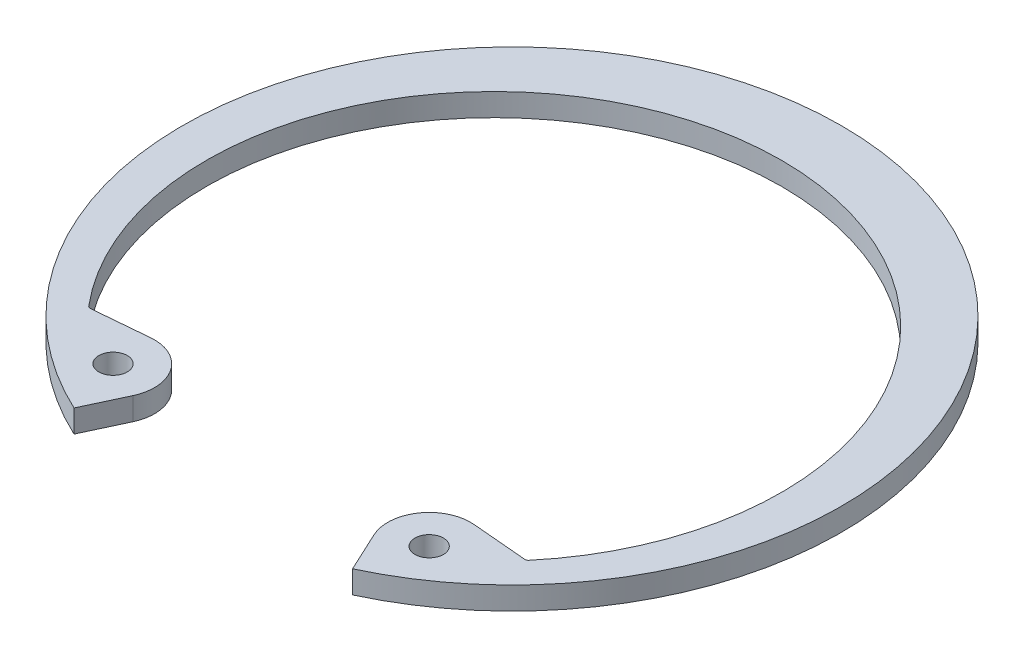
ISO-10303-21;
HEADER;
FILE_DESCRIPTION(('STEP AP214'),'2;1');
FILE_NAME('part.step','',(''),(''),'','','');
FILE_SCHEMA(('AUTOMOTIVE_DESIGN { 1 0 10303 214 1 1 1 1 }'));
ENDSEC;
DATA;
#1=APPLICATION_CONTEXT('core data for automotive mechanical design processes');
#2=APPLICATION_PROTOCOL_DEFINITION('international standard','automotive_design',2000,#1);
#3=PRODUCT_CONTEXT('',#1,'mechanical');
#4=PRODUCT('Part','Part','',(#3));
#5=PRODUCT_RELATED_PRODUCT_CATEGORY('part','',(#4));
#6=PRODUCT_DEFINITION_FORMATION('','',#4);
#7=PRODUCT_DEFINITION_CONTEXT('part definition',#1,'design');
#8=PRODUCT_DEFINITION('design','',#6,#7);
#9=PRODUCT_DEFINITION_SHAPE('','',#8);
#10=(LENGTH_UNIT() NAMED_UNIT(*) SI_UNIT(.MILLI.,.METRE.));
#11=(NAMED_UNIT(*) PLANE_ANGLE_UNIT() SI_UNIT($,.RADIAN.));
#12=(NAMED_UNIT(*) SI_UNIT($,.STERADIAN.) SOLID_ANGLE_UNIT());
#13=UNCERTAINTY_MEASURE_WITH_UNIT(LENGTH_MEASURE(1.E-05),#10,'distance_accuracy_value','');
#14=(GEOMETRIC_REPRESENTATION_CONTEXT(3) GLOBAL_UNCERTAINTY_ASSIGNED_CONTEXT((#13)) GLOBAL_UNIT_ASSIGNED_CONTEXT((#10,
#11,#12)) REPRESENTATION_CONTEXT('',''));
#15=CARTESIAN_POINT('',(0.,0.,0.));
#16=DIRECTION('',(0.,0.,1.));
#17=DIRECTION('',(1.,0.,0.));
#18=AXIS2_PLACEMENT_3D('',#15,#16,#17);
#19=CARTESIAN_POINT('',(10.9888036399848,-1.5748,16.744042909998));
#20=DIRECTION('',(0.,1.,0.));
#21=DIRECTION('',(0.,0.,1.));
#22=AXIS2_PLACEMENT_3D('',#19,#20,#21);
#23=CYLINDRICAL_SURFACE('',#22,2.8829);
#24=CARTESIAN_POINT('',(10.9888036399848,0.,16.744042909998));
#25=DIRECTION('',(0.,1.,0.));
#26=DIRECTION('',(0.,0.,-1.));
#27=AXIS2_PLACEMENT_3D('',#24,#25,#26);
#28=CIRCLE('',#27,2.8829);
#29=CARTESIAN_POINT('',(11.240064930752,0.,13.8721132148693));
#30=VERTEX_POINT('',#29);
#31=CARTESIAN_POINT('',(8.37600892073683,0.,17.9624090967702));
#32=VERTEX_POINT('',#31);
#33=EDGE_CURVE('E114',#30,#32,#28,.T.);
#34=ORIENTED_EDGE('',*,*,#33,.F.);
#35=DIRECTION('',(0.,1.,0.));
#36=VECTOR('',#35,1.);
#37=CARTESIAN_POINT('',(11.240064930752,-1.5748,13.8721132148693));
#38=LINE('',#37,#36);
#39=CARTESIAN_POINT('',(11.240064930752,-1.5748,13.8721132148693));
#40=VERTEX_POINT('',#39);
#41=EDGE_CURVE('E172',#40,#30,#38,.T.);
#42=ORIENTED_EDGE('',*,*,#41,.F.);
#43=CARTESIAN_POINT('',(10.9888036399848,-1.5748,16.744042909998));
#44=DIRECTION('',(0.,1.,0.));
#45=DIRECTION('',(0.,0.,-1.));
#46=AXIS2_PLACEMENT_3D('',#43,#44,#45);
#47=CIRCLE('',#46,2.8829);
#48=CARTESIAN_POINT('',(8.37600892073683,-1.5748,17.9624090967702));
#49=VERTEX_POINT('',#48);
#50=EDGE_CURVE('E116',#40,#49,#47,.T.);
#51=ORIENTED_EDGE('',*,*,#50,.T.);
#52=DIRECTION('',(0.,1.,0.));
#53=VECTOR('',#52,1.);
#54=CARTESIAN_POINT('',(8.37600892073683,-1.5748,17.9624090967702));
#55=LINE('',#54,#53);
#56=EDGE_CURVE('E110',#49,#32,#55,.T.);
#57=ORIENTED_EDGE('',*,*,#56,.T.);
#58=EDGE_LOOP('',(#34,#42,#51,#57));
#59=FACE_BOUND('',#58,.T.);
#60=ADVANCED_FACE('F36',(#59),#23,.T.);
#61=CARTESIAN_POINT('',(15.2181746807128,-1.5748,14.2201527202528));
#62=DIRECTION('',(0.0871557427476599,0.,-0.996194698091745));
#63=DIRECTION('',(-0.996194698091746,0.,-0.0871557427476599));
#64=AXIS2_PLACEMENT_3D('',#61,#62,#63);
#65=PLANE('',#64);
#66=DIRECTION('',(-0.996194698091745,0.,-0.0871557427476599));
#67=VECTOR('',#66,1.);
#68=CARTESIAN_POINT('',(15.2181746807128,0.,14.2201527202528));
#69=LINE('',#68,#67);
#70=CARTESIAN_POINT('',(15.0871573079693,0.,14.2086901854128));
#71=VERTEX_POINT('',#70);
#72=EDGE_CURVE('E131',#71,#30,#69,.T.);
#73=ORIENTED_EDGE('',*,*,#72,.F.);
#74=DIRECTION('',(0.,-1.,0.));
#75=VECTOR('',#74,1.);
#76=CARTESIAN_POINT('',(15.0871573079693,-1.5748,14.2086901854128));
#77=LINE('',#76,#75);
#78=CARTESIAN_POINT('',(15.0871573079693,-1.5748,14.2086901854128));
#79=VERTEX_POINT('',#78);
#80=EDGE_CURVE('E50',#71,#79,#77,.T.);
#81=ORIENTED_EDGE('',*,*,#80,.T.);
#82=DIRECTION('',(-0.996194698091745,0.,-0.0871557427476599));
#83=VECTOR('',#82,1.);
#84=CARTESIAN_POINT('',(15.2181746807128,-1.5748,14.2201527202528));
#85=LINE('',#84,#83);
#86=EDGE_CURVE('E121',#79,#40,#85,.T.);
#87=ORIENTED_EDGE('',*,*,#86,.T.);
#88=ORIENTED_EDGE('',*,*,#41,.T.);
#89=EDGE_LOOP('',(#73,#81,#87,#88));
#90=FACE_BOUND('',#89,.T.);
#91=ADVANCED_FACE('F213',(#90),#65,.T.);
#92=CARTESIAN_POINT('',(0.,-1.5748,1.25014680806621));
#93=DIRECTION('',(0.,1.,0.));
#94=DIRECTION('',(0.,0.,1.));
#95=AXIS2_PLACEMENT_3D('',#92,#93,#94);
#96=CYLINDRICAL_SURFACE('',#95,19.9953468080662);
#97=CARTESIAN_POINT('',(0.,0.,1.25014680806621));
#98=DIRECTION('',(0.,-1.,0.));
#99=DIRECTION('',(0.,0.,1.));
#100=AXIS2_PLACEMENT_3D('',#97,#98,#99);
#101=CIRCLE('',#100,19.9953468080662);
#102=CARTESIAN_POINT('',(-15.3036970486787,0.,14.119130863426));
#103=VERTEX_POINT('',#102);
#104=CARTESIAN_POINT('',(15.3036970486787,0.,14.119130863426));
#105=VERTEX_POINT('',#104);
#106=EDGE_CURVE('E150',#103,#105,#101,.T.);
#107=ORIENTED_EDGE('',*,*,#106,.F.);
#108=DIRECTION('',(0.,1.,0.));
#109=VECTOR('',#108,1.);
#110=CARTESIAN_POINT('',(-15.3036970486787,-1.5748,14.119130863426));
#111=LINE('',#110,#109);
#112=CARTESIAN_POINT('',(-15.3036970486787,-1.5748,14.119130863426));
#113=VERTEX_POINT('',#112);
#114=EDGE_CURVE('E187',#103,#113,#111,.F.);
#115=ORIENTED_EDGE('',*,*,#114,.T.);
#116=CARTESIAN_POINT('',(0.,-1.5748,1.25014680806621));
#117=DIRECTION('',(0.,-1.,0.));
#118=DIRECTION('',(0.,0.,1.));
#119=AXIS2_PLACEMENT_3D('',#116,#117,#118);
#120=CIRCLE('',#119,19.9953468080662);
#121=CARTESIAN_POINT('',(15.3036970486787,-1.5748,14.119130863426));
#122=VERTEX_POINT('',#121);
#123=EDGE_CURVE('E168',#113,#122,#120,.T.);
#124=ORIENTED_EDGE('',*,*,#123,.T.);
#125=DIRECTION('',(0.,1.,0.));
#126=VECTOR('',#125,1.);
#127=CARTESIAN_POINT('',(15.3036970486787,-1.5748,14.119130863426));
#128=LINE('',#127,#126);
#129=EDGE_CURVE('E184',#122,#105,#128,.T.);
#130=ORIENTED_EDGE('',*,*,#129,.T.);
#131=EDGE_LOOP('',(#107,#115,#124,#130));
#132=FACE_BOUND('',#131,.T.);
#133=ADVANCED_FACE('F208',(#132),#96,.F.);
#134=CARTESIAN_POINT('',(-15.2181746807128,-1.5748,14.2201527202528));
#135=DIRECTION('',(-0.0871557427476563,0.,-0.996194698091746));
#136=DIRECTION('',(-0.996194698091746,0.,0.0871557427476563));
#137=AXIS2_PLACEMENT_3D('',#134,#135,#136);
#138=PLANE('',#137);
#139=DIRECTION('',(-0.996194698091746,0.,0.0871557427476563));
#140=VECTOR('',#139,1.);
#141=CARTESIAN_POINT('',(-15.2181746807128,-1.5748,14.2201527202528));
#142=LINE('',#141,#140);
#143=CARTESIAN_POINT('',(-11.240064930752,-1.5748,13.8721132148693));
#144=VERTEX_POINT('',#143);
#145=CARTESIAN_POINT('',(-15.0871573079693,-1.5748,14.2086901854128));
#146=VERTEX_POINT('',#145);
#147=EDGE_CURVE('E165',#144,#146,#142,.T.);
#148=ORIENTED_EDGE('',*,*,#147,.T.);
#149=DIRECTION('',(0.,-1.,0.));
#150=VECTOR('',#149,1.);
#151=CARTESIAN_POINT('',(-15.0871573079693,0.,14.2086901854128));
#152=LINE('',#151,#150);
#153=CARTESIAN_POINT('',(-15.0871573079693,0.,14.2086901854128));
#154=VERTEX_POINT('',#153);
#155=EDGE_CURVE('E174',#146,#154,#152,.F.);
#156=ORIENTED_EDGE('',*,*,#155,.T.);
#157=DIRECTION('',(-0.996194698091746,0.,0.0871557427476563));
#158=VECTOR('',#157,1.);
#159=CARTESIAN_POINT('',(-15.2181746807128,0.,14.2201527202528));
#160=LINE('',#159,#158);
#161=CARTESIAN_POINT('',(-11.240064930752,0.,13.8721132148693));
#162=VERTEX_POINT('',#161);
#163=EDGE_CURVE('E147',#162,#154,#160,.T.);
#164=ORIENTED_EDGE('',*,*,#163,.F.);
#165=DIRECTION('',(0.,1.,0.));
#166=VECTOR('',#165,1.);
#167=CARTESIAN_POINT('',(-11.240064930752,-1.5748,13.8721132148693));
#168=LINE('',#167,#166);
#169=EDGE_CURVE('E175',#144,#162,#168,.T.);
#170=ORIENTED_EDGE('',*,*,#169,.F.);
#171=EDGE_LOOP('',(#148,#156,#164,#170));
#172=FACE_BOUND('',#171,.T.);
#173=ADVANCED_FACE('F203',(#172),#138,.T.);
#174=CARTESIAN_POINT('',(-10.9888036399848,-1.5748,16.744042909998));
#175=DIRECTION('',(0.,1.,0.));
#176=DIRECTION('',(0.,0.,1.));
#177=AXIS2_PLACEMENT_3D('',#174,#175,#176);
#178=CYLINDRICAL_SURFACE('',#177,2.8829);
#179=CARTESIAN_POINT('',(-10.9888036399848,0.,16.744042909998));
#180=DIRECTION('',(0.,1.,0.));
#181=DIRECTION('',(0.,0.,1.));
#182=AXIS2_PLACEMENT_3D('',#179,#180,#181);
#183=CIRCLE('',#182,2.8829);
#184=CARTESIAN_POINT('',(-8.37600892073683,0.,17.9624090967702));
#185=VERTEX_POINT('',#184);
#186=EDGE_CURVE('E144',#185,#162,#183,.T.);
#187=ORIENTED_EDGE('',*,*,#186,.F.);
#188=DIRECTION('',(0.,1.,0.));
#189=VECTOR('',#188,1.);
#190=CARTESIAN_POINT('',(-8.37600892073683,-1.5748,17.9624090967702));
#191=LINE('',#190,#189);
#192=CARTESIAN_POINT('',(-8.37600892073683,-1.5748,17.9624090967702));
#193=VERTEX_POINT('',#192);
#194=EDGE_CURVE('E177',#193,#185,#191,.T.);
#195=ORIENTED_EDGE('',*,*,#194,.F.);
#196=CARTESIAN_POINT('',(-10.9888036399848,-1.5748,16.744042909998));
#197=DIRECTION('',(0.,1.,0.));
#198=DIRECTION('',(0.,0.,1.));
#199=AXIS2_PLACEMENT_3D('',#196,#197,#198);
#200=CIRCLE('',#199,2.8829);
#201=EDGE_CURVE('E162',#193,#144,#200,.T.);
#202=ORIENTED_EDGE('',*,*,#201,.T.);
#203=ORIENTED_EDGE('',*,*,#169,.T.);
#204=EDGE_LOOP('',(#187,#195,#202,#203));
#205=FACE_BOUND('',#204,.T.);
#206=ADVANCED_FACE('F226',(#205),#178,.T.);
#207=CARTESIAN_POINT('',(-9.68252247108869,-1.5748,20.7642364472393));
#208=DIRECTION('',(0.906307787036652,0.,0.422618261740695));
#209=DIRECTION('',(0.422618261740695,0.,-0.906307787036652));
#210=AXIS2_PLACEMENT_3D('',#207,#208,#209);
#211=PLANE('',#210);
#212=DIRECTION('',(0.422618261740695,0.,-0.906307787036652));
#213=VECTOR('',#212,1.);
#214=CARTESIAN_POINT('',(-9.68252247108869,0.,20.7642364472393));
#215=LINE('',#214,#213);
#216=CARTESIAN_POINT('',(-9.6825224710887,0.,20.7642364472393));
#217=VERTEX_POINT('',#216);
#218=EDGE_CURVE('E141',#217,#185,#215,.T.);
#219=ORIENTED_EDGE('',*,*,#218,.F.);
#220=DIRECTION('',(0.,1.,0.));
#221=VECTOR('',#220,1.);
#222=CARTESIAN_POINT('',(-9.6825224710887,-1.5748,20.7642364472393));
#223=LINE('',#222,#221);
#224=CARTESIAN_POINT('',(-9.6825224710887,-1.5748,20.7642364472393));
#225=VERTEX_POINT('',#224);
#226=EDGE_CURVE('E179',#225,#217,#223,.T.);
#227=ORIENTED_EDGE('',*,*,#226,.F.);
#228=DIRECTION('',(0.422618261740695,0.,-0.906307787036652));
#229=VECTOR('',#228,1.);
#230=CARTESIAN_POINT('',(-9.68252247108869,-1.5748,20.7642364472393));
#231=LINE('',#230,#229);
#232=EDGE_CURVE('E159',#225,#193,#231,.T.);
#233=ORIENTED_EDGE('',*,*,#232,.T.);
#234=ORIENTED_EDGE('',*,*,#194,.T.);
#235=EDGE_LOOP('',(#219,#227,#233,#234));
#236=FACE_BOUND('',#235,.T.);
#237=ADVANCED_FACE('F229',(#236),#211,.T.);
#238=CARTESIAN_POINT('',(0.,-1.5748,0.));
#239=DIRECTION('',(0.,1.,0.));
#240=DIRECTION('',(0.,0.,1.));
#241=AXIS2_PLACEMENT_3D('',#238,#239,#240);
#242=CYLINDRICAL_SURFACE('',#241,22.9108);
#243=CARTESIAN_POINT('',(0.,0.,0.));
#244=DIRECTION('',(0.,1.,0.));
#245=DIRECTION('',(0.,0.,1.));
#246=AXIS2_PLACEMENT_3D('',#243,#244,#245);
#247=CIRCLE('',#246,22.9108);
#248=CARTESIAN_POINT('',(9.68252247108869,0.,20.7642364472393));
#249=VERTEX_POINT('',#248);
#250=EDGE_CURVE('E128',#249,#217,#247,.T.);
#251=ORIENTED_EDGE('',*,*,#250,.F.);
#252=DIRECTION('',(0.,1.,0.));
#253=VECTOR('',#252,1.);
#254=CARTESIAN_POINT('',(9.68252247108869,-1.5748,20.7642364472393));
#255=LINE('',#254,#253);
#256=CARTESIAN_POINT('',(9.68252247108869,-1.5748,20.7642364472393));
#257=VERTEX_POINT('',#256);
#258=EDGE_CURVE('E120',#257,#249,#255,.T.);
#259=ORIENTED_EDGE('',*,*,#258,.F.);
#260=CARTESIAN_POINT('',(0.,-1.5748,0.));
#261=DIRECTION('',(0.,1.,0.));
#262=DIRECTION('',(0.,0.,1.));
#263=AXIS2_PLACEMENT_3D('',#260,#261,#262);
#264=CIRCLE('',#263,22.9108);
#265=EDGE_CURVE('E156',#257,#225,#264,.T.);
#266=ORIENTED_EDGE('',*,*,#265,.T.);
#267=ORIENTED_EDGE('',*,*,#226,.T.);
#268=EDGE_LOOP('',(#251,#259,#266,#267));
#269=FACE_BOUND('',#268,.T.);
#270=ADVANCED_FACE('F233',(#269),#242,.T.);
#271=CARTESIAN_POINT('',(9.68252247108869,-1.5748,20.7642364472393));
#272=DIRECTION('',(-0.906307787036652,0.,0.422618261740695));
#273=DIRECTION('',(0.422618261740695,0.,0.906307787036652));
#274=AXIS2_PLACEMENT_3D('',#271,#272,#273);
#275=PLANE('',#274);
#276=DIRECTION('',(0.422618261740695,0.,0.906307787036652));
#277=VECTOR('',#276,1.);
#278=CARTESIAN_POINT('',(9.68252247108869,0.,20.7642364472393));
#279=LINE('',#278,#277);
#280=EDGE_CURVE('E124',#32,#249,#279,.T.);
#281=ORIENTED_EDGE('',*,*,#280,.F.);
#282=ORIENTED_EDGE('',*,*,#56,.F.);
#283=DIRECTION('',(0.422618261740695,0.,0.906307787036652));
#284=VECTOR('',#283,1.);
#285=CARTESIAN_POINT('',(9.68252247108869,-1.5748,20.7642364472393));
#286=LINE('',#285,#284);
#287=EDGE_CURVE('E154',#49,#257,#286,.T.);
#288=ORIENTED_EDGE('',*,*,#287,.T.);
#289=ORIENTED_EDGE('',*,*,#258,.T.);
#290=EDGE_LOOP('',(#281,#282,#288,#289));
#291=FACE_BOUND('',#290,.T.);
#292=ADVANCED_FACE('F125',(#291),#275,.T.);
#293=CARTESIAN_POINT('',(10.9888036399848,-1.5748,16.744042909998));
#294=DIRECTION('',(0.,-1.,0.));
#295=DIRECTION('',(0.,0.,-1.));
#296=AXIS2_PLACEMENT_3D('',#293,#294,#295);
#297=PLANE('',#296);
#298=CARTESIAN_POINT('',(-10.9888036399848,-1.5748,16.744042909998));
#299=DIRECTION('',(0.,1.,0.));
#300=DIRECTION('',(0.,0.,1.));
#301=AXIS2_PLACEMENT_3D('',#298,#299,#300);
#302=CIRCLE('',#301,0.990599999999999);
#303=CARTESIAN_POINT('',(-10.9888036399848,-1.5748,17.734642909998));
#304=VERTEX_POINT('',#303);
#305=EDGE_CURVE('E250',#304,#304,#302,.T.);
#306=ORIENTED_EDGE('',*,*,#305,.T.);
#307=EDGE_LOOP('',(#306));
#308=FACE_BOUND('',#307,.T.);
#309=CARTESIAN_POINT('',(10.9888036399848,-1.5748,16.744042909998));
#310=DIRECTION('',(0.,1.,0.));
#311=DIRECTION('',(0.,0.,1.));
#312=AXIS2_PLACEMENT_3D('',#309,#310,#311);
#313=CIRCLE('',#312,0.990599999999999);
#314=CARTESIAN_POINT('',(10.9888036399848,-1.5748,17.734642909998));
#315=VERTEX_POINT('',#314);
#316=EDGE_CURVE('E133',#315,#315,#313,.T.);
#317=ORIENTED_EDGE('',*,*,#316,.T.);
#318=EDGE_LOOP('',(#317));
#319=FACE_BOUND('',#318,.T.);
#320=ORIENTED_EDGE('',*,*,#50,.F.);
#321=ORIENTED_EDGE('',*,*,#86,.F.);
#322=CARTESIAN_POINT('',(15.1092948666272,-1.5748,13.9556567320975));
#323=DIRECTION('',(0.,-1.,0.));
#324=DIRECTION('',(0.,0.,-1.));
#325=AXIS2_PLACEMENT_3D('',#322,#323,#324);
#326=CIRCLE('',#325,0.254);
#327=EDGE_CURVE('E11',#79,#122,#326,.F.);
#328=ORIENTED_EDGE('',*,*,#327,.T.);
#329=ORIENTED_EDGE('',*,*,#123,.F.);
#330=CARTESIAN_POINT('',(-15.1092948666272,-1.5748,13.9556567320975));
#331=DIRECTION('',(0.,-1.,0.));
#332=DIRECTION('',(0.,0.,-1.));
#333=AXIS2_PLACEMENT_3D('',#330,#331,#332);
#334=CIRCLE('',#333,0.254);
#335=EDGE_CURVE('E192',#113,#146,#334,.F.);
#336=ORIENTED_EDGE('',*,*,#335,.T.);
#337=ORIENTED_EDGE('',*,*,#147,.F.);
#338=ORIENTED_EDGE('',*,*,#201,.F.);
#339=ORIENTED_EDGE('',*,*,#232,.F.);
#340=ORIENTED_EDGE('',*,*,#265,.F.);
#341=ORIENTED_EDGE('',*,*,#287,.F.);
#342=EDGE_LOOP('',(#320,#321,#328,#329,#336,#337,#338,#339,#340,#341));
#343=FACE_BOUND('',#342,.T.);
#344=ADVANCED_FACE('F197',(#308,#319,#343),#297,.T.);
#345=CARTESIAN_POINT('',(10.9888036399848,0.,16.744042909998));
#346=DIRECTION('',(0.,-1.,0.));
#347=DIRECTION('',(0.,0.,-1.));
#348=AXIS2_PLACEMENT_3D('',#345,#346,#347);
#349=PLANE('',#348);
#350=CARTESIAN_POINT('',(-10.9888036399848,0.,16.744042909998));
#351=DIRECTION('',(0.,1.,0.));
#352=DIRECTION('',(0.,0.,1.));
#353=AXIS2_PLACEMENT_3D('',#350,#351,#352);
#354=CIRCLE('',#353,0.990599999999999);
#355=CARTESIAN_POINT('',(-10.9888036399848,0.,17.734642909998));
#356=VERTEX_POINT('',#355);
#357=EDGE_CURVE('E260',#356,#356,#354,.T.);
#358=ORIENTED_EDGE('',*,*,#357,.F.);
#359=EDGE_LOOP('',(#358));
#360=FACE_BOUND('',#359,.T.);
#361=CARTESIAN_POINT('',(10.9888036399848,0.,16.744042909998));
#362=DIRECTION('',(0.,1.,0.));
#363=DIRECTION('',(0.,0.,1.));
#364=AXIS2_PLACEMENT_3D('',#361,#362,#363);
#365=CIRCLE('',#364,0.990599999999999);
#366=CARTESIAN_POINT('',(10.9888036399848,0.,17.734642909998));
#367=VERTEX_POINT('',#366);
#368=EDGE_CURVE('E136',#367,#367,#365,.T.);
#369=ORIENTED_EDGE('',*,*,#368,.F.);
#370=EDGE_LOOP('',(#369));
#371=FACE_BOUND('',#370,.T.);
#372=ORIENTED_EDGE('',*,*,#33,.T.);
#373=ORIENTED_EDGE('',*,*,#280,.T.);
#374=ORIENTED_EDGE('',*,*,#250,.T.);
#375=ORIENTED_EDGE('',*,*,#218,.T.);
#376=ORIENTED_EDGE('',*,*,#186,.T.);
#377=ORIENTED_EDGE('',*,*,#163,.T.);
#378=CARTESIAN_POINT('',(-15.1092948666272,0.,13.9556567320975));
#379=DIRECTION('',(0.,-1.,0.));
#380=DIRECTION('',(0.,0.,-1.));
#381=AXIS2_PLACEMENT_3D('',#378,#379,#380);
#382=CIRCLE('',#381,0.254);
#383=EDGE_CURVE('E190',#154,#103,#382,.T.);
#384=ORIENTED_EDGE('',*,*,#383,.T.);
#385=ORIENTED_EDGE('',*,*,#106,.T.);
#386=CARTESIAN_POINT('',(15.1092948666272,0.,13.9556567320975));
#387=DIRECTION('',(0.,-1.,0.));
#388=DIRECTION('',(0.,0.,-1.));
#389=AXIS2_PLACEMENT_3D('',#386,#387,#388);
#390=CIRCLE('',#389,0.254);
#391=EDGE_CURVE('E43',#105,#71,#390,.T.);
#392=ORIENTED_EDGE('',*,*,#391,.T.);
#393=ORIENTED_EDGE('',*,*,#72,.T.);
#394=EDGE_LOOP('',(#372,#373,#374,#375,#376,#377,#384,#385,#392,#393));
#395=FACE_BOUND('',#394,.T.);
#396=ADVANCED_FACE('F130',(#360,#371,#395),#349,.F.);
#397=CARTESIAN_POINT('',(10.9888036399848,-1.5748,16.744042909998));
#398=DIRECTION('',(0.,1.,0.));
#399=DIRECTION('',(0.,0.,1.));
#400=AXIS2_PLACEMENT_3D('',#397,#398,#399);
#401=CYLINDRICAL_SURFACE('',#400,0.990599999999999);
#402=ORIENTED_EDGE('',*,*,#316,.F.);
#403=EDGE_LOOP('',(#402));
#404=FACE_BOUND('',#403,.T.);
#405=ORIENTED_EDGE('',*,*,#368,.T.);
#406=EDGE_LOOP('',(#405));
#407=FACE_BOUND('',#406,.T.);
#408=ADVANCED_FACE('F245',(#404,#407),#401,.F.);
#409=CARTESIAN_POINT('',(-10.9888036399848,-1.5748,16.744042909998));
#410=DIRECTION('',(0.,1.,0.));
#411=DIRECTION('',(0.,0.,1.));
#412=AXIS2_PLACEMENT_3D('',#409,#410,#411);
#413=CYLINDRICAL_SURFACE('',#412,0.990599999999999);
#414=ORIENTED_EDGE('',*,*,#305,.F.);
#415=EDGE_LOOP('',(#414));
#416=FACE_BOUND('',#415,.T.);
#417=ORIENTED_EDGE('',*,*,#357,.T.);
#418=EDGE_LOOP('',(#417));
#419=FACE_BOUND('',#418,.T.);
#420=ADVANCED_FACE('F255',(#416,#419),#413,.F.);
#421=CARTESIAN_POINT('',(-15.1092948666272,-1.5748,13.9556567320975));
#422=DIRECTION('',(0.,1.,0.));
#423=DIRECTION('',(0.,0.,1.));
#424=AXIS2_PLACEMENT_3D('',#421,#422,#423);
#425=CYLINDRICAL_SURFACE('',#424,0.254);
#426=ORIENTED_EDGE('',*,*,#335,.F.);
#427=ORIENTED_EDGE('',*,*,#114,.F.);
#428=ORIENTED_EDGE('',*,*,#383,.F.);
#429=ORIENTED_EDGE('',*,*,#155,.F.);
#430=EDGE_LOOP('',(#426,#427,#428,#429));
#431=FACE_BOUND('',#430,.T.);
#432=ADVANCED_FACE('F205',(#431),#425,.F.);
#433=CARTESIAN_POINT('',(15.1092948666272,-1.5748,13.9556567320975));
#434=DIRECTION('',(0.,1.,0.));
#435=DIRECTION('',(0.,0.,1.));
#436=AXIS2_PLACEMENT_3D('',#433,#434,#435);
#437=CYLINDRICAL_SURFACE('',#436,0.254);
#438=ORIENTED_EDGE('',*,*,#327,.F.);
#439=ORIENTED_EDGE('',*,*,#80,.F.);
#440=ORIENTED_EDGE('',*,*,#391,.F.);
#441=ORIENTED_EDGE('',*,*,#129,.F.);
#442=EDGE_LOOP('',(#438,#439,#440,#441));
#443=FACE_BOUND('',#442,.T.);
#444=ADVANCED_FACE('F212',(#443),#437,.F.);
#445=CLOSED_SHELL('',(#60,#91,#133,#173,#206,#237,#270,#292,#344,#396,#408,#420,#432,#444));
#446=MANIFOLD_SOLID_BREP('B2',#445);
#447=ADVANCED_BREP_SHAPE_REPRESENTATION('',(#18,#446),#14);
#448=SHAPE_DEFINITION_REPRESENTATION(#9,#447);
ENDSEC;
END-ISO-10303-21;
